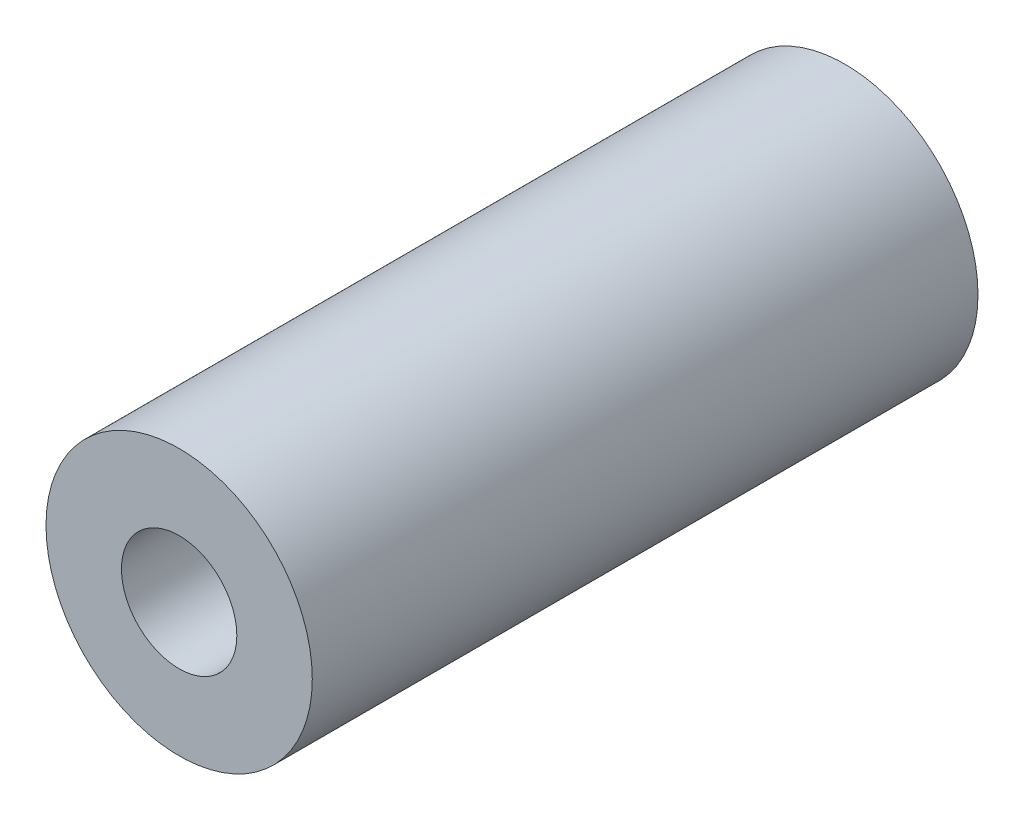
ISO-10303-21;
HEADER;
FILE_DESCRIPTION(('STEP AP214'),'2;1');
FILE_NAME('part.step','',(''),(''),'','','');
FILE_SCHEMA(('AUTOMOTIVE_DESIGN { 1 0 10303 214 1 1 1 1 }'));
ENDSEC;
DATA;
#1=APPLICATION_CONTEXT('core data for automotive mechanical design processes');
#2=APPLICATION_PROTOCOL_DEFINITION('international standard','automotive_design',2000,#1);
#3=PRODUCT_CONTEXT('',#1,'mechanical');
#4=PRODUCT('Part','Part','',(#3));
#5=PRODUCT_RELATED_PRODUCT_CATEGORY('part','',(#4));
#6=PRODUCT_DEFINITION_FORMATION('','',#4);
#7=PRODUCT_DEFINITION_CONTEXT('part definition',#1,'design');
#8=PRODUCT_DEFINITION('design','',#6,#7);
#9=PRODUCT_DEFINITION_SHAPE('','',#8);
#10=(LENGTH_UNIT() NAMED_UNIT(*) SI_UNIT(.MILLI.,.METRE.));
#11=(NAMED_UNIT(*) PLANE_ANGLE_UNIT() SI_UNIT($,.RADIAN.));
#12=(NAMED_UNIT(*) SI_UNIT($,.STERADIAN.) SOLID_ANGLE_UNIT());
#13=UNCERTAINTY_MEASURE_WITH_UNIT(LENGTH_MEASURE(1.E-05),#10,'distance_accuracy_value','');
#14=(GEOMETRIC_REPRESENTATION_CONTEXT(3) GLOBAL_UNCERTAINTY_ASSIGNED_CONTEXT((#13)) GLOBAL_UNIT_ASSIGNED_CONTEXT((#10,
#11,#12)) REPRESENTATION_CONTEXT('',''));
#15=CARTESIAN_POINT('',(0.,0.,0.));
#16=DIRECTION('',(0.,0.,1.));
#17=DIRECTION('',(1.,0.,0.));
#18=AXIS2_PLACEMENT_3D('',#15,#16,#17);
#19=CARTESIAN_POINT('',(0.,0.,30.));
#20=DIRECTION('',(0.,0.,1.));
#21=DIRECTION('',(1.,0.,0.));
#22=AXIS2_PLACEMENT_3D('',#19,#20,#21);
#23=PLANE('',#22);
#24=CARTESIAN_POINT('',(0.,0.,30.));
#25=DIRECTION('',(0.,0.,1.));
#26=DIRECTION('',(1.,0.,0.));
#27=AXIS2_PLACEMENT_3D('',#24,#25,#26);
#28=CIRCLE('',#27,6.);
#29=CARTESIAN_POINT('',(6.,0.,30.));
#30=VERTEX_POINT('',#29);
#31=EDGE_CURVE('E10',#30,#30,#28,.T.);
#32=ORIENTED_EDGE('',*,*,#31,.T.);
#33=EDGE_LOOP('',(#32));
#34=FACE_BOUND('',#33,.T.);
#35=CARTESIAN_POINT('',(0.,0.,30.));
#36=DIRECTION('',(0.,0.,1.));
#37=DIRECTION('',(1.,0.,0.));
#38=AXIS2_PLACEMENT_3D('',#35,#36,#37);
#39=CIRCLE('',#38,2.6);
#40=CARTESIAN_POINT('',(2.6,0.,30.));
#41=VERTEX_POINT('',#40);
#42=EDGE_CURVE('E42',#41,#41,#39,.T.);
#43=ORIENTED_EDGE('',*,*,#42,.F.);
#44=EDGE_LOOP('',(#43));
#45=FACE_BOUND('',#44,.T.);
#46=ADVANCED_FACE('F31',(#34,#45),#23,.T.);
#47=CARTESIAN_POINT('',(0.,0.,0.));
#48=DIRECTION('',(0.,0.,1.));
#49=DIRECTION('',(1.,0.,0.));
#50=AXIS2_PLACEMENT_3D('',#47,#48,#49);
#51=PLANE('',#50);
#52=CARTESIAN_POINT('',(0.,0.,0.));
#53=DIRECTION('',(0.,0.,1.));
#54=DIRECTION('',(1.,0.,0.));
#55=AXIS2_PLACEMENT_3D('',#52,#53,#54);
#56=CIRCLE('',#55,6.);
#57=CARTESIAN_POINT('',(6.,0.,0.));
#58=VERTEX_POINT('',#57);
#59=EDGE_CURVE('E35',#58,#58,#56,.T.);
#60=ORIENTED_EDGE('',*,*,#59,.F.);
#61=EDGE_LOOP('',(#60));
#62=FACE_BOUND('',#61,.T.);
#63=CARTESIAN_POINT('',(0.,0.,0.));
#64=DIRECTION('',(0.,0.,1.));
#65=DIRECTION('',(1.,0.,0.));
#66=AXIS2_PLACEMENT_3D('',#63,#64,#65);
#67=CIRCLE('',#66,2.6);
#68=CARTESIAN_POINT('',(2.6,0.,0.));
#69=VERTEX_POINT('',#68);
#70=EDGE_CURVE('E44',#69,#69,#67,.T.);
#71=ORIENTED_EDGE('',*,*,#70,.T.);
#72=EDGE_LOOP('',(#71));
#73=FACE_BOUND('',#72,.T.);
#74=ADVANCED_FACE('F54',(#62,#73),#51,.F.);
#75=CARTESIAN_POINT('',(0.,0.,30.));
#76=DIRECTION('',(0.,0.,-1.));
#77=DIRECTION('',(-1.,0.,0.));
#78=AXIS2_PLACEMENT_3D('',#75,#76,#77);
#79=CYLINDRICAL_SURFACE('',#78,6.);
#80=ORIENTED_EDGE('',*,*,#31,.F.);
#81=EDGE_LOOP('',(#80));
#82=FACE_BOUND('',#81,.T.);
#83=ORIENTED_EDGE('',*,*,#59,.T.);
#84=EDGE_LOOP('',(#83));
#85=FACE_BOUND('',#84,.T.);
#86=ADVANCED_FACE('F33',(#82,#85),#79,.T.);
#87=CARTESIAN_POINT('',(0.,0.,30.));
#88=DIRECTION('',(0.,0.,-1.));
#89=DIRECTION('',(-1.,0.,0.));
#90=AXIS2_PLACEMENT_3D('',#87,#88,#89);
#91=CYLINDRICAL_SURFACE('',#90,2.6);
#92=ORIENTED_EDGE('',*,*,#42,.T.);
#93=EDGE_LOOP('',(#92));
#94=FACE_BOUND('',#93,.T.);
#95=ORIENTED_EDGE('',*,*,#70,.F.);
#96=EDGE_LOOP('',(#95));
#97=FACE_BOUND('',#96,.T.);
#98=ADVANCED_FACE('F50',(#94,#97),#91,.F.);
#99=CLOSED_SHELL('',(#46,#74,#86,#98));
#100=MANIFOLD_SOLID_BREP('B2',#99);
#101=ADVANCED_BREP_SHAPE_REPRESENTATION('',(#18,#100),#14);
#102=SHAPE_DEFINITION_REPRESENTATION(#9,#101);
ENDSEC;
END-ISO-10303-21;
